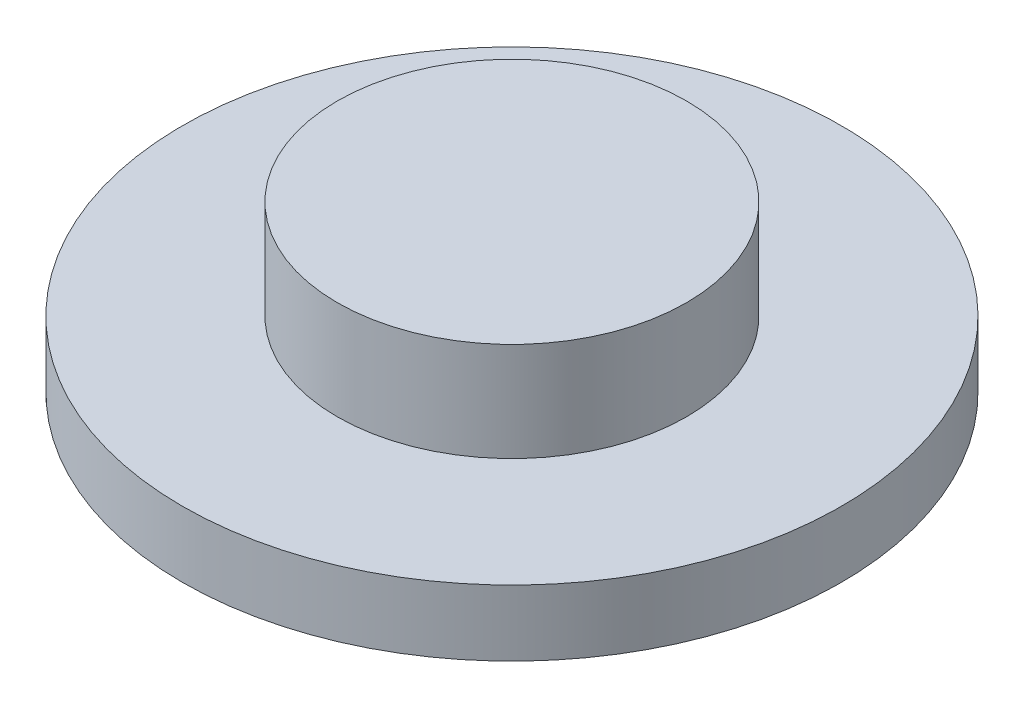
ISO-10303-21;
HEADER;
FILE_DESCRIPTION(('STEP AP214'),'2;1');
FILE_NAME('part.step','',(''),(''),'','','');
FILE_SCHEMA(('AUTOMOTIVE_DESIGN { 1 0 10303 214 1 1 1 1 }'));
ENDSEC;
DATA;
#1=APPLICATION_CONTEXT('core data for automotive mechanical design processes');
#2=APPLICATION_PROTOCOL_DEFINITION('international standard','automotive_design',2000,#1);
#3=PRODUCT_CONTEXT('',#1,'mechanical');
#4=PRODUCT('Part','Part','',(#3));
#5=PRODUCT_RELATED_PRODUCT_CATEGORY('part','',(#4));
#6=PRODUCT_DEFINITION_FORMATION('','',#4);
#7=PRODUCT_DEFINITION_CONTEXT('part definition',#1,'design');
#8=PRODUCT_DEFINITION('design','',#6,#7);
#9=PRODUCT_DEFINITION_SHAPE('','',#8);
#10=(LENGTH_UNIT() NAMED_UNIT(*) SI_UNIT(.MILLI.,.METRE.));
#11=(NAMED_UNIT(*) PLANE_ANGLE_UNIT() SI_UNIT($,.RADIAN.));
#12=(NAMED_UNIT(*) SI_UNIT($,.STERADIAN.) SOLID_ANGLE_UNIT());
#13=UNCERTAINTY_MEASURE_WITH_UNIT(LENGTH_MEASURE(1.E-05),#10,'distance_accuracy_value','');
#14=(GEOMETRIC_REPRESENTATION_CONTEXT(3) GLOBAL_UNCERTAINTY_ASSIGNED_CONTEXT((#13)) GLOBAL_UNIT_ASSIGNED_CONTEXT((#10,
#11,#12)) REPRESENTATION_CONTEXT('',''));
#15=CARTESIAN_POINT('',(0.,0.,0.));
#16=DIRECTION('',(0.,0.,1.));
#17=DIRECTION('',(1.,0.,0.));
#18=AXIS2_PLACEMENT_3D('',#15,#16,#17);
#19=CARTESIAN_POINT('',(0.,3.,0.));
#20=DIRECTION('',(0.,-1.,0.));
#21=DIRECTION('',(0.,0.,-1.));
#22=AXIS2_PLACEMENT_3D('',#19,#20,#21);
#23=CYLINDRICAL_SURFACE('',#22,15.);
#24=CARTESIAN_POINT('',(0.,3.,0.));
#25=DIRECTION('',(0.,1.,0.));
#26=DIRECTION('',(0.,0.,1.));
#27=AXIS2_PLACEMENT_3D('',#24,#25,#26);
#28=CIRCLE('',#27,15.);
#29=CARTESIAN_POINT('',(0.,3.,15.));
#30=VERTEX_POINT('',#29);
#31=EDGE_CURVE('E46',#30,#30,#28,.T.);
#32=ORIENTED_EDGE('',*,*,#31,.F.);
#33=EDGE_LOOP('',(#32));
#34=FACE_BOUND('',#33,.T.);
#35=CARTESIAN_POINT('',(0.,0.,0.));
#36=DIRECTION('',(0.,1.,0.));
#37=DIRECTION('',(0.,0.,1.));
#38=AXIS2_PLACEMENT_3D('',#35,#36,#37);
#39=CIRCLE('',#38,15.);
#40=CARTESIAN_POINT('',(0.,0.,15.));
#41=VERTEX_POINT('',#40);
#42=EDGE_CURVE('E42',#41,#41,#39,.T.);
#43=ORIENTED_EDGE('',*,*,#42,.T.);
#44=EDGE_LOOP('',(#43));
#45=FACE_BOUND('',#44,.T.);
#46=ADVANCED_FACE('F39',(#34,#45),#23,.T.);
#47=CARTESIAN_POINT('',(0.,3.,0.));
#48=DIRECTION('',(0.,1.,0.));
#49=DIRECTION('',(0.,0.,1.));
#50=AXIS2_PLACEMENT_3D('',#47,#48,#49);
#51=PLANE('',#50);
#52=CARTESIAN_POINT('',(0.,3.,0.));
#53=DIRECTION('',(0.,1.,0.));
#54=DIRECTION('',(0.,0.,1.));
#55=AXIS2_PLACEMENT_3D('',#52,#53,#54);
#56=CIRCLE('',#55,7.95);
#57=CARTESIAN_POINT('',(0.,3.,7.95));
#58=VERTEX_POINT('',#57);
#59=EDGE_CURVE('E10',#58,#58,#56,.T.);
#60=ORIENTED_EDGE('',*,*,#59,.F.);
#61=EDGE_LOOP('',(#60));
#62=FACE_BOUND('',#61,.T.);
#63=ORIENTED_EDGE('',*,*,#31,.T.);
#64=EDGE_LOOP('',(#63));
#65=FACE_BOUND('',#64,.T.);
#66=ADVANCED_FACE('F63',(#62,#65),#51,.T.);
#67=CARTESIAN_POINT('',(0.,0.,0.));
#68=DIRECTION('',(0.,1.,0.));
#69=DIRECTION('',(0.,0.,1.));
#70=AXIS2_PLACEMENT_3D('',#67,#68,#69);
#71=PLANE('',#70);
#72=ORIENTED_EDGE('',*,*,#42,.F.);
#73=EDGE_LOOP('',(#72));
#74=FACE_BOUND('',#73,.T.);
#75=ADVANCED_FACE('F60',(#74),#71,.F.);
#76=CARTESIAN_POINT('',(0.,7.5,0.));
#77=DIRECTION('',(0.,-1.,0.));
#78=DIRECTION('',(0.,0.,-1.));
#79=AXIS2_PLACEMENT_3D('',#76,#77,#78);
#80=CYLINDRICAL_SURFACE('',#79,7.95);
#81=CARTESIAN_POINT('',(0.,7.5,0.));
#82=DIRECTION('',(0.,1.,0.));
#83=DIRECTION('',(0.,0.,1.));
#84=AXIS2_PLACEMENT_3D('',#81,#82,#83);
#85=CIRCLE('',#84,7.95);
#86=CARTESIAN_POINT('',(0.,7.5,7.95));
#87=VERTEX_POINT('',#86);
#88=EDGE_CURVE('E52',#87,#87,#85,.T.);
#89=ORIENTED_EDGE('',*,*,#88,.F.);
#90=EDGE_LOOP('',(#89));
#91=FACE_BOUND('',#90,.T.);
#92=ORIENTED_EDGE('',*,*,#59,.T.);
#93=EDGE_LOOP('',(#92));
#94=FACE_BOUND('',#93,.T.);
#95=ADVANCED_FACE('F62',(#91,#94),#80,.T.);
#96=CARTESIAN_POINT('',(0.,7.5,0.));
#97=DIRECTION('',(0.,1.,0.));
#98=DIRECTION('',(0.,0.,1.));
#99=AXIS2_PLACEMENT_3D('',#96,#97,#98);
#100=PLANE('',#99);
#101=ORIENTED_EDGE('',*,*,#88,.T.);
#102=EDGE_LOOP('',(#101));
#103=FACE_BOUND('',#102,.T.);
#104=ADVANCED_FACE('F69',(#103),#100,.T.);
#105=CLOSED_SHELL('',(#46,#66,#75,#95,#104));
#106=MANIFOLD_SOLID_BREP('B2',#105);
#107=ADVANCED_BREP_SHAPE_REPRESENTATION('',(#18,#106),#14);
#108=SHAPE_DEFINITION_REPRESENTATION(#9,#107);
ENDSEC;
END-ISO-10303-21;
